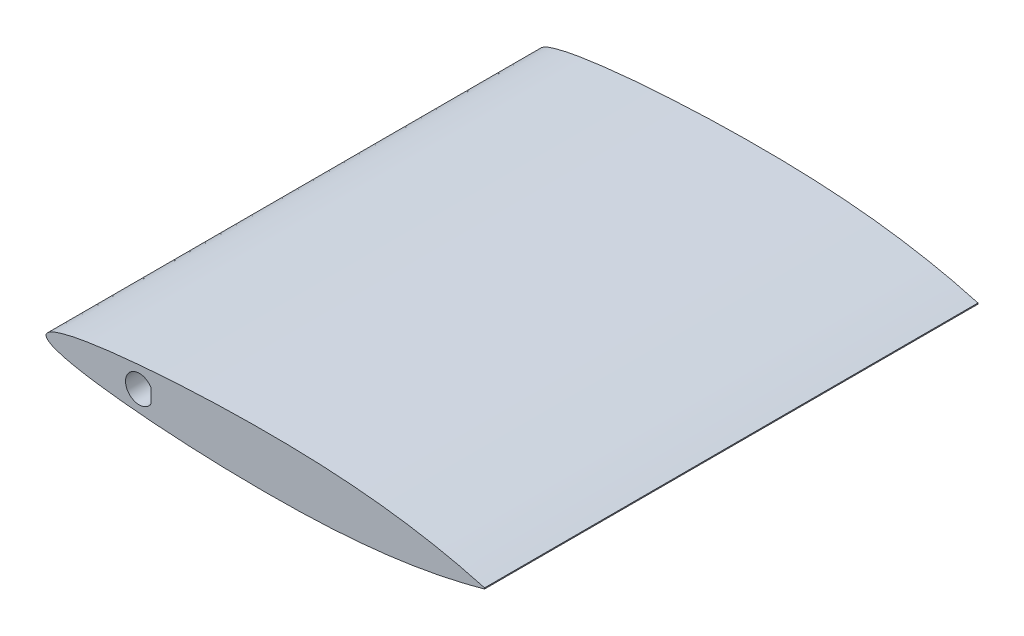
ISO-10303-21;
HEADER;
FILE_DESCRIPTION(('STEP AP214'),'2;1');
FILE_NAME('part.step','',(''),(''),'','','');
FILE_SCHEMA(('AUTOMOTIVE_DESIGN { 1 0 10303 214 1 1 1 1 }'));
ENDSEC;
DATA;
#1=APPLICATION_CONTEXT('core data for automotive mechanical design processes');
#2=APPLICATION_PROTOCOL_DEFINITION('international standard','automotive_design',2000,#1);
#3=PRODUCT_CONTEXT('',#1,'mechanical');
#4=PRODUCT('Part','Part','',(#3));
#5=PRODUCT_RELATED_PRODUCT_CATEGORY('part','',(#4));
#6=PRODUCT_DEFINITION_FORMATION('','',#4);
#7=PRODUCT_DEFINITION_CONTEXT('part definition',#1,'design');
#8=PRODUCT_DEFINITION('design','',#6,#7);
#9=PRODUCT_DEFINITION_SHAPE('','',#8);
#10=(LENGTH_UNIT() NAMED_UNIT(*) SI_UNIT(.MILLI.,.METRE.));
#11=(NAMED_UNIT(*) PLANE_ANGLE_UNIT() SI_UNIT($,.RADIAN.));
#12=(NAMED_UNIT(*) SI_UNIT($,.STERADIAN.) SOLID_ANGLE_UNIT());
#13=UNCERTAINTY_MEASURE_WITH_UNIT(LENGTH_MEASURE(1.E-05),#10,'distance_accuracy_value','');
#14=(GEOMETRIC_REPRESENTATION_CONTEXT(3) GLOBAL_UNCERTAINTY_ASSIGNED_CONTEXT((#13)) GLOBAL_UNIT_ASSIGNED_CONTEXT((#10,
#11,#12)) REPRESENTATION_CONTEXT('',''));
#15=CARTESIAN_POINT('',(0.,0.,0.));
#16=DIRECTION('',(0.,0.,1.));
#17=DIRECTION('',(1.,0.,0.));
#18=AXIS2_PLACEMENT_3D('',#15,#16,#17);
#19=CARTESIAN_POINT('',(0.,0.,114.3));
#20=DIRECTION('',(0.,0.,-1.));
#21=DIRECTION('',(-1.,0.,0.));
#22=AXIS2_PLACEMENT_3D('',#19,#20,#21);
#23=PLANE('',#22);
#24=CARTESIAN_POINT('',(101.6,0.12192,114.3));
#25=CARTESIAN_POINT('',(99.9099325612772,0.573751352181052,114.3));
#26=CARTESIAN_POINT('',(96.5445159680375,1.47347919447663,114.3));
#27=CARTESIAN_POINT('',(89.7838148331715,2.94708160059314,114.3));
#28=CARTESIAN_POINT('',(81.3219135939672,4.36676175035151,114.3));
#29=CARTESIAN_POINT('',(71.1402798710456,5.43635651611942,114.3));
#30=CARTESIAN_POINT('',(60.9671026158848,5.99664541123932,114.3));
#31=CARTESIAN_POINT('',(50.8000062626756,6.1452466793128,114.3));
#32=CARTESIAN_POINT('',(40.6356759168472,5.99825351295323,114.3));
#33=CARTESIAN_POINT('',(30.4708305225493,5.55295405436998,114.3));
#34=CARTESIAN_POINT('',(22.0030483871038,4.93293242186221,114.3));
#35=CARTESIAN_POINT('',(15.230811890989,4.22316272662785,114.3));
#36=CARTESIAN_POINT('',(10.9986814626437,3.664214628241,114.3));
#37=CARTESIAN_POINT('',(7.60803033342346,3.09224166583172,114.3));
#38=CARTESIAN_POINT('',(5.07214941301361,2.58080453358446,114.3));
#39=CARTESIAN_POINT('',(2.89436287038461,1.97088859116428,114.3));
#40=CARTESIAN_POINT('',(1.18166517439631,1.36420918614566,114.3));
#41=CARTESIAN_POINT('',(-0.674617494040787,0.,114.3));
#42=CARTESIAN_POINT('',(1.18166517439633,-1.36420918614567,114.3));
#43=CARTESIAN_POINT('',(2.89436287038458,-1.97088859116427,114.3));
#44=CARTESIAN_POINT('',(5.07214941301364,-2.58080453358447,114.3));
#45=CARTESIAN_POINT('',(7.60803033342344,-3.09224166583172,114.3));
#46=CARTESIAN_POINT('',(10.9986814626437,-3.66421462824101,114.3));
#47=CARTESIAN_POINT('',(15.230811890989,-4.22316272662785,114.3));
#48=CARTESIAN_POINT('',(22.0030483871038,-4.93293242186221,114.3));
#49=CARTESIAN_POINT('',(30.4708305225493,-5.55295405436998,114.3));
#50=CARTESIAN_POINT('',(40.6356759168473,-5.99825351295323,114.3));
#51=CARTESIAN_POINT('',(50.8000062626756,-6.1452466793128,114.3));
#52=CARTESIAN_POINT('',(60.9671026158848,-5.99664541123932,114.3));
#53=CARTESIAN_POINT('',(71.1402798710456,-5.43635651611942,114.3));
#54=CARTESIAN_POINT('',(81.3219135939672,-4.3667617503515,114.3));
#55=CARTESIAN_POINT('',(89.7838148331716,-2.94708160059315,114.3));
#56=CARTESIAN_POINT('',(96.5445159680374,-1.47347919447663,114.3));
#57=CARTESIAN_POINT('',(99.9099325612772,-0.573751352181052,114.3));
#58=CARTESIAN_POINT('',(101.6,-0.12192,114.3));
#59=B_SPLINE_CURVE_WITH_KNOTS('',3,(#24,#25,#26,#27,#28,#29,#30,#31,#32,#33,#34,#35,#36,#37,#38,
#39,#40,#41,#42,#43,#44,#45,#46,#47,#48,#49,#50,#51,#52,#53,#54,#55,#56,#57,#58),.UNSPECIFIED.,
.F.,.F.,(4,1,1,1,1,1,1,1,1,1,1,1,1,1,1,1,1,1,1,1,1,1,1,1,1,1,1,1,1,1,1,1,4),(0.,
0.0254561411236664,0.0506905924429752,0.100668945434382,0.150236314349449,0.19960123058025,
0.24889397315785,0.298185188052663,0.347518475522579,0.396944040111351,0.421724595809467,
0.44659314081436,0.4590914269835,0.471679671517261,0.484480399814962,0.491139796608888,0.5,
0.508860203391112,0.515519600185038,0.528320328482739,0.5409085730165,0.55340685918564,
0.578275404190533,0.603055959888649,0.652481524477421,0.701814811947337,0.75110602684215,
0.80039876941975,0.849763685650551,0.899331054565618,0.949309407557025,0.974543858876334,1.),.UNSPECIFIED.);
#60=CARTESIAN_POINT('',(101.6,0.12192,114.3));
#61=VERTEX_POINT('',#60);
#62=CARTESIAN_POINT('',(101.6,-0.12192,114.3));
#63=VERTEX_POINT('',#62);
#64=EDGE_CURVE('E91',#61,#63,#59,.T.);
#65=ORIENTED_EDGE('',*,*,#64,.T.);
#66=DIRECTION('',(0.,1.,0.));
#67=VECTOR('',#66,1.);
#68=CARTESIAN_POINT('',(101.6,0.12192,114.3));
#69=LINE('',#68,#67);
#70=EDGE_CURVE('E97',#63,#61,#69,.T.);
#71=ORIENTED_EDGE('',*,*,#70,.T.);
#72=EDGE_LOOP('',(#65,#71));
#73=FACE_BOUND('',#72,.T.);
#74=DIRECTION('',(0.,-1.,0.));
#75=VECTOR('',#74,1.);
#76=CARTESIAN_POINT('',(24.3496306570156,0.,114.3));
#77=LINE('',#76,#75);
#78=CARTESIAN_POINT('',(24.3496306570156,1.5875,114.3));
#79=VERTEX_POINT('',#78);
#80=CARTESIAN_POINT('',(24.3496306570156,-1.5875,114.3));
#81=VERTEX_POINT('',#80);
#82=EDGE_CURVE('E49',#79,#81,#77,.T.);
#83=ORIENTED_EDGE('',*,*,#82,.T.);
#84=CARTESIAN_POINT('',(21.6,0.,114.3));
#85=DIRECTION('',(0.,0.,1.));
#86=DIRECTION('',(1.,0.,0.));
#87=AXIS2_PLACEMENT_3D('',#84,#85,#86);
#88=CIRCLE('',#87,3.175);
#89=EDGE_CURVE('E85',#79,#81,#88,.T.);
#90=ORIENTED_EDGE('',*,*,#89,.F.);
#91=EDGE_LOOP('',(#83,#90));
#92=FACE_BOUND('',#91,.T.);
#93=ADVANCED_FACE('F33',(#73,#92),#23,.F.);
#94=CARTESIAN_POINT('',(0.,0.,0.));
#95=DIRECTION('',(0.,0.,-1.));
#96=DIRECTION('',(-1.,0.,0.));
#97=AXIS2_PLACEMENT_3D('',#94,#95,#96);
#98=PLANE('',#97);
#99=CARTESIAN_POINT('',(101.6,0.12192,0.));
#100=CARTESIAN_POINT('',(99.9099325612772,0.573751352181052,0.));
#101=CARTESIAN_POINT('',(96.5445159680375,1.47347919447663,0.));
#102=CARTESIAN_POINT('',(89.7838148331715,2.94708160059314,0.));
#103=CARTESIAN_POINT('',(81.3219135939672,4.36676175035151,0.));
#104=CARTESIAN_POINT('',(71.1402798710456,5.43635651611942,0.));
#105=CARTESIAN_POINT('',(60.9671026158848,5.99664541123932,0.));
#106=CARTESIAN_POINT('',(50.8000062626756,6.1452466793128,0.));
#107=CARTESIAN_POINT('',(40.6356759168472,5.99825351295323,0.));
#108=CARTESIAN_POINT('',(30.4708305225493,5.55295405436998,0.));
#109=CARTESIAN_POINT('',(22.0030483871038,4.93293242186221,0.));
#110=CARTESIAN_POINT('',(15.230811890989,4.22316272662785,0.));
#111=CARTESIAN_POINT('',(10.9986814626437,3.664214628241,0.));
#112=CARTESIAN_POINT('',(7.60803033342346,3.09224166583172,0.));
#113=CARTESIAN_POINT('',(5.07214941301361,2.58080453358446,0.));
#114=CARTESIAN_POINT('',(2.89436287038461,1.97088859116428,0.));
#115=CARTESIAN_POINT('',(1.18166517439631,1.36420918614566,0.));
#116=CARTESIAN_POINT('',(-0.674617494040787,0.,0.));
#117=CARTESIAN_POINT('',(1.18166517439633,-1.36420918614567,0.));
#118=CARTESIAN_POINT('',(2.89436287038458,-1.97088859116427,0.));
#119=CARTESIAN_POINT('',(5.07214941301364,-2.58080453358447,0.));
#120=CARTESIAN_POINT('',(7.60803033342344,-3.09224166583172,0.));
#121=CARTESIAN_POINT('',(10.9986814626437,-3.66421462824101,0.));
#122=CARTESIAN_POINT('',(15.230811890989,-4.22316272662785,0.));
#123=CARTESIAN_POINT('',(22.0030483871038,-4.93293242186221,0.));
#124=CARTESIAN_POINT('',(30.4708305225493,-5.55295405436998,0.));
#125=CARTESIAN_POINT('',(40.6356759168473,-5.99825351295323,0.));
#126=CARTESIAN_POINT('',(50.8000062626756,-6.1452466793128,0.));
#127=CARTESIAN_POINT('',(60.9671026158848,-5.99664541123932,0.));
#128=CARTESIAN_POINT('',(71.1402798710456,-5.43635651611942,0.));
#129=CARTESIAN_POINT('',(81.3219135939672,-4.3667617503515,0.));
#130=CARTESIAN_POINT('',(89.7838148331716,-2.94708160059315,0.));
#131=CARTESIAN_POINT('',(96.5445159680374,-1.47347919447663,0.));
#132=CARTESIAN_POINT('',(99.9099325612772,-0.573751352181052,0.));
#133=CARTESIAN_POINT('',(101.6,-0.12192,0.));
#134=B_SPLINE_CURVE_WITH_KNOTS('',3,(#99,#100,#101,#102,#103,#104,#105,#106,#107,#108,#109,#110,
#111,#112,#113,#114,#115,#116,#117,#118,#119,#120,#121,#122,#123,#124,#125,#126,#127,#128,#129,
#130,#131,#132,#133),.UNSPECIFIED.,.F.,.F.,(4,1,1,1,1,1,1,1,1,1,1,1,1,1,1,1,1,1,1,1,1,1,1,1,1,1,
1,1,1,1,1,1,4),(0.,0.0254561411236664,0.0506905924429752,0.100668945434382,0.150236314349449,
0.19960123058025,0.24889397315785,0.298185188052663,0.347518475522579,0.396944040111351,
0.421724595809467,0.44659314081436,0.4590914269835,0.471679671517261,0.484480399814962,
0.491139796608888,0.5,0.508860203391112,0.515519600185038,0.528320328482739,0.5409085730165,
0.55340685918564,0.578275404190533,0.603055959888649,0.652481524477421,0.701814811947337,
0.75110602684215,0.80039876941975,0.849763685650551,0.899331054565618,0.949309407557025,
0.974543858876334,1.),.UNSPECIFIED.);
#135=CARTESIAN_POINT('',(101.6,0.12192,0.));
#136=VERTEX_POINT('',#135);
#137=CARTESIAN_POINT('',(101.6,-0.12192,0.));
#138=VERTEX_POINT('',#137);
#139=EDGE_CURVE('E90',#136,#138,#134,.T.);
#140=ORIENTED_EDGE('',*,*,#139,.F.);
#141=DIRECTION('',(0.,1.,0.));
#142=VECTOR('',#141,1.);
#143=CARTESIAN_POINT('',(101.6,0.12192,0.));
#144=LINE('',#143,#142);
#145=EDGE_CURVE('E98',#138,#136,#144,.T.);
#146=ORIENTED_EDGE('',*,*,#145,.F.);
#147=EDGE_LOOP('',(#140,#146));
#148=FACE_BOUND('',#147,.T.);
#149=CARTESIAN_POINT('',(21.6,0.,0.));
#150=DIRECTION('',(0.,0.,1.));
#151=DIRECTION('',(1.,0.,0.));
#152=AXIS2_PLACEMENT_3D('',#149,#150,#151);
#153=CIRCLE('',#152,3.175);
#154=CARTESIAN_POINT('',(24.3496306570156,1.5875,0.));
#155=VERTEX_POINT('',#154);
#156=CARTESIAN_POINT('',(24.3496306570156,-1.5875,0.));
#157=VERTEX_POINT('',#156);
#158=EDGE_CURVE('E79',#155,#157,#153,.T.);
#159=ORIENTED_EDGE('',*,*,#158,.T.);
#160=DIRECTION('',(0.,-1.,0.));
#161=VECTOR('',#160,1.);
#162=CARTESIAN_POINT('',(24.3496306570156,0.,0.));
#163=LINE('',#162,#161);
#164=EDGE_CURVE('E76',#155,#157,#163,.T.);
#165=ORIENTED_EDGE('',*,*,#164,.F.);
#166=EDGE_LOOP('',(#159,#165));
#167=FACE_BOUND('',#166,.T.);
#168=ADVANCED_FACE('F84',(#148,#167),#98,.T.);
#169=DIRECTION('',(0.,0.,-1.));
#170=VECTOR('',#169,1.);
#171=SURFACE_OF_LINEAR_EXTRUSION('',#59,#170);
#172=ORIENTED_EDGE('',*,*,#139,.T.);
#173=DIRECTION('',(0.,0.,-1.));
#174=VECTOR('',#173,1.);
#175=CARTESIAN_POINT('',(101.6,-0.12192,114.3));
#176=LINE('',#175,#174);
#177=EDGE_CURVE('E11',#63,#138,#176,.T.);
#178=ORIENTED_EDGE('',*,*,#177,.F.);
#179=ORIENTED_EDGE('',*,*,#64,.F.);
#180=DIRECTION('',(0.,0.,-1.));
#181=VECTOR('',#180,1.);
#182=CARTESIAN_POINT('',(101.6,0.12192,114.3));
#183=LINE('',#182,#181);
#184=EDGE_CURVE('E42',#61,#136,#183,.T.);
#185=ORIENTED_EDGE('',*,*,#184,.T.);
#186=EDGE_LOOP('',(#172,#178,#179,#185));
#187=FACE_BOUND('',#186,.T.);
#188=ADVANCED_FACE('F35',(#187),#171,.F.);
#189=CARTESIAN_POINT('',(101.6,0.12192,114.3));
#190=DIRECTION('',(-1.,0.,0.));
#191=DIRECTION('',(0.,-1.,0.));
#192=AXIS2_PLACEMENT_3D('',#189,#190,#191);
#193=PLANE('',#192);
#194=ORIENTED_EDGE('',*,*,#145,.T.);
#195=ORIENTED_EDGE('',*,*,#184,.F.);
#196=ORIENTED_EDGE('',*,*,#70,.F.);
#197=ORIENTED_EDGE('',*,*,#177,.T.);
#198=EDGE_LOOP('',(#194,#195,#196,#197));
#199=FACE_BOUND('',#198,.T.);
#200=ADVANCED_FACE('F118',(#199),#193,.F.);
#201=CARTESIAN_POINT('',(24.3496306570156,0.,0.));
#202=DIRECTION('',(-1.,0.,0.));
#203=DIRECTION('',(0.,0.,1.));
#204=AXIS2_PLACEMENT_3D('',#201,#202,#203);
#205=PLANE('',#204);
#206=ORIENTED_EDGE('',*,*,#82,.F.);
#207=DIRECTION('',(0.,0.,1.));
#208=VECTOR('',#207,1.);
#209=CARTESIAN_POINT('',(24.3496306570156,1.5875,0.));
#210=LINE('',#209,#208);
#211=EDGE_CURVE('E73',#155,#79,#210,.T.);
#212=ORIENTED_EDGE('',*,*,#211,.F.);
#213=ORIENTED_EDGE('',*,*,#164,.T.);
#214=DIRECTION('',(0.,0.,1.));
#215=VECTOR('',#214,1.);
#216=CARTESIAN_POINT('',(24.3496306570156,-1.5875,0.));
#217=LINE('',#216,#215);
#218=EDGE_CURVE('E56',#157,#81,#217,.T.);
#219=ORIENTED_EDGE('',*,*,#218,.T.);
#220=EDGE_LOOP('',(#206,#212,#213,#219));
#221=FACE_BOUND('',#220,.T.);
#222=ADVANCED_FACE('F74',(#221),#205,.T.);
#223=CARTESIAN_POINT('',(21.6,0.,0.));
#224=DIRECTION('',(0.,0.,1.));
#225=DIRECTION('',(1.,0.,0.));
#226=AXIS2_PLACEMENT_3D('',#223,#224,#225);
#227=CYLINDRICAL_SURFACE('',#226,3.175);
#228=ORIENTED_EDGE('',*,*,#89,.T.);
#229=ORIENTED_EDGE('',*,*,#218,.F.);
#230=ORIENTED_EDGE('',*,*,#158,.F.);
#231=ORIENTED_EDGE('',*,*,#211,.T.);
#232=EDGE_LOOP('',(#228,#229,#230,#231));
#233=FACE_BOUND('',#232,.T.);
#234=ADVANCED_FACE('F81',(#233),#227,.F.);
#235=CLOSED_SHELL('',(#93,#168,#188,#200,#222,#234));
#236=MANIFOLD_SOLID_BREP('B2',#235);
#237=ADVANCED_BREP_SHAPE_REPRESENTATION('',(#18,#236),#14);
#238=SHAPE_DEFINITION_REPRESENTATION(#9,#237);
ENDSEC;
END-ISO-10303-21;
